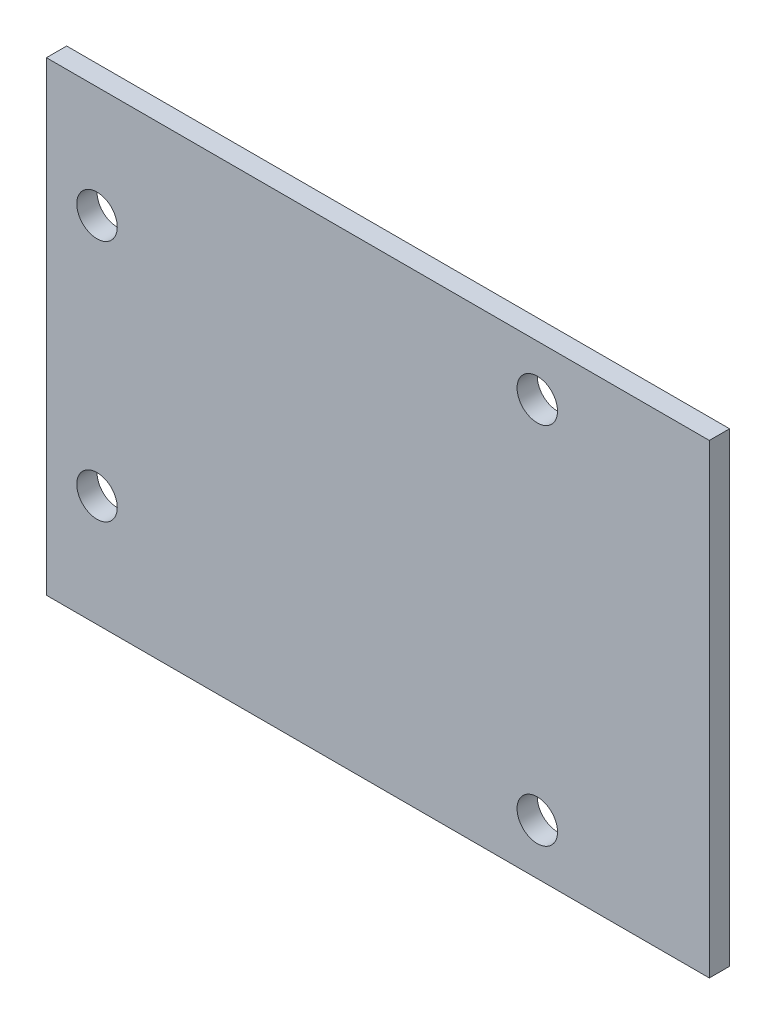
ISO-10303-21;
HEADER;
FILE_DESCRIPTION(('STEP AP214'),'2;1');
FILE_NAME('part.step','',(''),(''),'','','');
FILE_SCHEMA(('AUTOMOTIVE_DESIGN { 1 0 10303 214 1 1 1 1 }'));
ENDSEC;
DATA;
#1=APPLICATION_CONTEXT('core data for automotive mechanical design processes');
#2=APPLICATION_PROTOCOL_DEFINITION('international standard','automotive_design',2000,#1);
#3=PRODUCT_CONTEXT('',#1,'mechanical');
#4=PRODUCT('Part','Part','',(#3));
#5=PRODUCT_RELATED_PRODUCT_CATEGORY('part','',(#4));
#6=PRODUCT_DEFINITION_FORMATION('','',#4);
#7=PRODUCT_DEFINITION_CONTEXT('part definition',#1,'design');
#8=PRODUCT_DEFINITION('design','',#6,#7);
#9=PRODUCT_DEFINITION_SHAPE('','',#8);
#10=(LENGTH_UNIT() NAMED_UNIT(*) SI_UNIT(.MILLI.,.METRE.));
#11=(NAMED_UNIT(*) PLANE_ANGLE_UNIT() SI_UNIT($,.RADIAN.));
#12=(NAMED_UNIT(*) SI_UNIT($,.STERADIAN.) SOLID_ANGLE_UNIT());
#13=UNCERTAINTY_MEASURE_WITH_UNIT(LENGTH_MEASURE(1.E-05),#10,'distance_accuracy_value','');
#14=(GEOMETRIC_REPRESENTATION_CONTEXT(3) GLOBAL_UNCERTAINTY_ASSIGNED_CONTEXT((#13)) GLOBAL_UNIT_ASSIGNED_CONTEXT((#10,
#11,#12)) REPRESENTATION_CONTEXT('',''));
#15=CARTESIAN_POINT('',(0.,0.,0.));
#16=DIRECTION('',(0.,0.,1.));
#17=DIRECTION('',(1.,0.,0.));
#18=AXIS2_PLACEMENT_3D('',#15,#16,#17);
#19=CARTESIAN_POINT('',(0.,0.,2.));
#20=DIRECTION('',(1.,0.,0.));
#21=DIRECTION('',(0.,0.,-1.));
#22=AXIS2_PLACEMENT_3D('',#19,#20,#21);
#23=PLANE('',#22);
#24=DIRECTION('',(0.,-1.,0.));
#25=VECTOR('',#24,1.);
#26=CARTESIAN_POINT('',(0.,0.,0.));
#27=LINE('',#26,#25);
#28=CARTESIAN_POINT('',(0.,46.,0.));
#29=VERTEX_POINT('',#28);
#30=CARTESIAN_POINT('',(0.,0.,0.));
#31=VERTEX_POINT('',#30);
#32=EDGE_CURVE('E96',#29,#31,#27,.T.);
#33=ORIENTED_EDGE('',*,*,#32,.T.);
#34=DIRECTION('',(0.,0.,-1.));
#35=VECTOR('',#34,1.);
#36=CARTESIAN_POINT('',(0.,0.,2.));
#37=LINE('',#36,#35);
#38=CARTESIAN_POINT('',(0.,0.,2.));
#39=VERTEX_POINT('',#38);
#40=EDGE_CURVE('E11',#39,#31,#37,.T.);
#41=ORIENTED_EDGE('',*,*,#40,.F.);
#42=DIRECTION('',(0.,-1.,0.));
#43=VECTOR('',#42,1.);
#44=CARTESIAN_POINT('',(0.,0.,2.));
#45=LINE('',#44,#43);
#46=CARTESIAN_POINT('',(0.,46.,2.));
#47=VERTEX_POINT('',#46);
#48=EDGE_CURVE('E84',#47,#39,#45,.T.);
#49=ORIENTED_EDGE('',*,*,#48,.F.);
#50=DIRECTION('',(0.,0.,-1.));
#51=VECTOR('',#50,1.);
#52=CARTESIAN_POINT('',(0.,46.,2.));
#53=LINE('',#52,#51);
#54=EDGE_CURVE('E92',#47,#29,#53,.T.);
#55=ORIENTED_EDGE('',*,*,#54,.T.);
#56=EDGE_LOOP('',(#33,#41,#49,#55));
#57=FACE_BOUND('',#56,.T.);
#58=ADVANCED_FACE('F33',(#57),#23,.F.);
#59=CARTESIAN_POINT('',(0.,0.,2.));
#60=DIRECTION('',(0.,1.,0.));
#61=DIRECTION('',(0.,0.,1.));
#62=AXIS2_PLACEMENT_3D('',#59,#60,#61);
#63=PLANE('',#62);
#64=DIRECTION('',(1.,0.,0.));
#65=VECTOR('',#64,1.);
#66=CARTESIAN_POINT('',(0.,0.,0.));
#67=LINE('',#66,#65);
#68=CARTESIAN_POINT('',(65.5,0.,0.));
#69=VERTEX_POINT('',#68);
#70=EDGE_CURVE('E88',#31,#69,#67,.T.);
#71=ORIENTED_EDGE('',*,*,#70,.T.);
#72=DIRECTION('',(0.,0.,-1.));
#73=VECTOR('',#72,1.);
#74=CARTESIAN_POINT('',(65.5,0.,2.));
#75=LINE('',#74,#73);
#76=CARTESIAN_POINT('',(65.5,0.,2.));
#77=VERTEX_POINT('',#76);
#78=EDGE_CURVE('E41',#77,#69,#75,.T.);
#79=ORIENTED_EDGE('',*,*,#78,.F.);
#80=DIRECTION('',(1.,0.,0.));
#81=VECTOR('',#80,1.);
#82=CARTESIAN_POINT('',(0.,0.,2.));
#83=LINE('',#82,#81);
#84=EDGE_CURVE('E79',#39,#77,#83,.T.);
#85=ORIENTED_EDGE('',*,*,#84,.F.);
#86=ORIENTED_EDGE('',*,*,#40,.T.);
#87=EDGE_LOOP('',(#71,#79,#85,#86));
#88=FACE_BOUND('',#87,.T.);
#89=ADVANCED_FACE('F87',(#88),#63,.F.);
#90=CARTESIAN_POINT('',(65.5,0.,2.));
#91=DIRECTION('',(-1.,0.,0.));
#92=DIRECTION('',(0.,0.,1.));
#93=AXIS2_PLACEMENT_3D('',#90,#91,#92);
#94=PLANE('',#93);
#95=DIRECTION('',(0.,1.,0.));
#96=VECTOR('',#95,1.);
#97=CARTESIAN_POINT('',(65.5,0.,0.));
#98=LINE('',#97,#96);
#99=CARTESIAN_POINT('',(65.5,46.,0.));
#100=VERTEX_POINT('',#99);
#101=EDGE_CURVE('E66',#69,#100,#98,.T.);
#102=ORIENTED_EDGE('',*,*,#101,.T.);
#103=DIRECTION('',(0.,0.,-1.));
#104=VECTOR('',#103,1.);
#105=CARTESIAN_POINT('',(65.5,46.,2.));
#106=LINE('',#105,#104);
#107=CARTESIAN_POINT('',(65.5,46.,2.));
#108=VERTEX_POINT('',#107);
#109=EDGE_CURVE('E89',#108,#100,#106,.T.);
#110=ORIENTED_EDGE('',*,*,#109,.F.);
#111=DIRECTION('',(0.,1.,0.));
#112=VECTOR('',#111,1.);
#113=CARTESIAN_POINT('',(65.5,0.,2.));
#114=LINE('',#113,#112);
#115=EDGE_CURVE('E82',#77,#108,#114,.T.);
#116=ORIENTED_EDGE('',*,*,#115,.F.);
#117=ORIENTED_EDGE('',*,*,#78,.T.);
#118=EDGE_LOOP('',(#102,#110,#116,#117));
#119=FACE_BOUND('',#118,.T.);
#120=ADVANCED_FACE('F90',(#119),#94,.F.);
#121=CARTESIAN_POINT('',(0.,46.,2.));
#122=DIRECTION('',(0.,-1.,0.));
#123=DIRECTION('',(0.,0.,-1.));
#124=AXIS2_PLACEMENT_3D('',#121,#122,#123);
#125=PLANE('',#124);
#126=DIRECTION('',(-1.,0.,0.));
#127=VECTOR('',#126,1.);
#128=CARTESIAN_POINT('',(0.,46.,0.));
#129=LINE('',#128,#127);
#130=EDGE_CURVE('E72',#100,#29,#129,.T.);
#131=ORIENTED_EDGE('',*,*,#130,.T.);
#132=ORIENTED_EDGE('',*,*,#54,.F.);
#133=DIRECTION('',(-1.,0.,0.));
#134=VECTOR('',#133,1.);
#135=CARTESIAN_POINT('',(0.,46.,2.));
#136=LINE('',#135,#134);
#137=EDGE_CURVE('E49',#108,#47,#136,.T.);
#138=ORIENTED_EDGE('',*,*,#137,.F.);
#139=ORIENTED_EDGE('',*,*,#109,.T.);
#140=EDGE_LOOP('',(#131,#132,#138,#139));
#141=FACE_BOUND('',#140,.T.);
#142=ADVANCED_FACE('F104',(#141),#125,.F.);
#143=CARTESIAN_POINT('',(0.,0.,2.));
#144=DIRECTION('',(0.,0.,-1.));
#145=DIRECTION('',(-1.,0.,0.));
#146=AXIS2_PLACEMENT_3D('',#143,#144,#145);
#147=PLANE('',#146);
#148=CARTESIAN_POINT('',(5.,35.,2.));
#149=DIRECTION('',(0.,0.,1.));
#150=DIRECTION('',(1.,0.,0.));
#151=AXIS2_PLACEMENT_3D('',#148,#149,#150);
#152=CIRCLE('',#151,2.);
#153=CARTESIAN_POINT('',(7.00000000000001,35.,2.));
#154=VERTEX_POINT('',#153);
#155=EDGE_CURVE('E128',#154,#154,#152,.T.);
#156=ORIENTED_EDGE('',*,*,#155,.F.);
#157=EDGE_LOOP('',(#156));
#158=FACE_BOUND('',#157,.T.);
#159=CARTESIAN_POINT('',(48.5,41.,2.));
#160=DIRECTION('',(0.,0.,1.));
#161=DIRECTION('',(1.,0.,0.));
#162=AXIS2_PLACEMENT_3D('',#159,#160,#161);
#163=CIRCLE('',#162,2.);
#164=CARTESIAN_POINT('',(50.5,41.,2.));
#165=VERTEX_POINT('',#164);
#166=EDGE_CURVE('E122',#165,#165,#163,.T.);
#167=ORIENTED_EDGE('',*,*,#166,.F.);
#168=EDGE_LOOP('',(#167));
#169=FACE_BOUND('',#168,.T.);
#170=CARTESIAN_POINT('',(48.5,5.,2.));
#171=DIRECTION('',(0.,0.,1.));
#172=DIRECTION('',(1.,0.,0.));
#173=AXIS2_PLACEMENT_3D('',#170,#171,#172);
#174=CIRCLE('',#173,2.);
#175=CARTESIAN_POINT('',(50.5,5.,2.));
#176=VERTEX_POINT('',#175);
#177=EDGE_CURVE('E116',#176,#176,#174,.T.);
#178=ORIENTED_EDGE('',*,*,#177,.F.);
#179=EDGE_LOOP('',(#178));
#180=FACE_BOUND('',#179,.T.);
#181=CARTESIAN_POINT('',(5.,11.,2.));
#182=DIRECTION('',(0.,0.,1.));
#183=DIRECTION('',(1.,0.,0.));
#184=AXIS2_PLACEMENT_3D('',#181,#182,#183);
#185=CIRCLE('',#184,2.);
#186=CARTESIAN_POINT('',(7.,11.,2.));
#187=VERTEX_POINT('',#186);
#188=EDGE_CURVE('E110',#187,#187,#185,.T.);
#189=ORIENTED_EDGE('',*,*,#188,.F.);
#190=EDGE_LOOP('',(#189));
#191=FACE_BOUND('',#190,.T.);
#192=ORIENTED_EDGE('',*,*,#48,.T.);
#193=ORIENTED_EDGE('',*,*,#84,.T.);
#194=ORIENTED_EDGE('',*,*,#115,.T.);
#195=ORIENTED_EDGE('',*,*,#137,.T.);
#196=EDGE_LOOP('',(#192,#193,#194,#195));
#197=FACE_BOUND('',#196,.T.);
#198=ADVANCED_FACE('F80',(#158,#169,#180,#191,#197),#147,.F.);
#199=CARTESIAN_POINT('',(0.,0.,0.));
#200=DIRECTION('',(0.,0.,-1.));
#201=DIRECTION('',(-1.,0.,0.));
#202=AXIS2_PLACEMENT_3D('',#199,#200,#201);
#203=PLANE('',#202);
#204=CARTESIAN_POINT('',(5.,35.,0.));
#205=DIRECTION('',(0.,0.,1.));
#206=DIRECTION('',(1.,0.,0.));
#207=AXIS2_PLACEMENT_3D('',#204,#205,#206);
#208=CIRCLE('',#207,2.);
#209=CARTESIAN_POINT('',(7.00000000000001,35.,0.));
#210=VERTEX_POINT('',#209);
#211=EDGE_CURVE('E113',#210,#210,#208,.T.);
#212=ORIENTED_EDGE('',*,*,#211,.T.);
#213=EDGE_LOOP('',(#212));
#214=FACE_BOUND('',#213,.T.);
#215=CARTESIAN_POINT('',(48.5,41.,0.));
#216=DIRECTION('',(0.,0.,1.));
#217=DIRECTION('',(1.,0.,0.));
#218=AXIS2_PLACEMENT_3D('',#215,#216,#217);
#219=CIRCLE('',#218,2.);
#220=CARTESIAN_POINT('',(50.5,41.,0.));
#221=VERTEX_POINT('',#220);
#222=EDGE_CURVE('E125',#221,#221,#219,.T.);
#223=ORIENTED_EDGE('',*,*,#222,.T.);
#224=EDGE_LOOP('',(#223));
#225=FACE_BOUND('',#224,.T.);
#226=CARTESIAN_POINT('',(48.5,5.,0.));
#227=DIRECTION('',(0.,0.,1.));
#228=DIRECTION('',(1.,0.,0.));
#229=AXIS2_PLACEMENT_3D('',#226,#227,#228);
#230=CIRCLE('',#229,2.);
#231=CARTESIAN_POINT('',(50.5,5.,0.));
#232=VERTEX_POINT('',#231);
#233=EDGE_CURVE('E119',#232,#232,#230,.T.);
#234=ORIENTED_EDGE('',*,*,#233,.T.);
#235=EDGE_LOOP('',(#234));
#236=FACE_BOUND('',#235,.T.);
#237=CARTESIAN_POINT('',(5.,11.,0.));
#238=DIRECTION('',(0.,0.,1.));
#239=DIRECTION('',(1.,0.,0.));
#240=AXIS2_PLACEMENT_3D('',#237,#238,#239);
#241=CIRCLE('',#240,2.);
#242=CARTESIAN_POINT('',(7.,11.,0.));
#243=VERTEX_POINT('',#242);
#244=EDGE_CURVE('E99',#243,#243,#241,.T.);
#245=ORIENTED_EDGE('',*,*,#244,.T.);
#246=EDGE_LOOP('',(#245));
#247=FACE_BOUND('',#246,.T.);
#248=ORIENTED_EDGE('',*,*,#32,.F.);
#249=ORIENTED_EDGE('',*,*,#130,.F.);
#250=ORIENTED_EDGE('',*,*,#101,.F.);
#251=ORIENTED_EDGE('',*,*,#70,.F.);
#252=EDGE_LOOP('',(#248,#249,#250,#251));
#253=FACE_BOUND('',#252,.T.);
#254=ADVANCED_FACE('F107',(#214,#225,#236,#247,#253),#203,.T.);
#255=CARTESIAN_POINT('',(5.,11.,0.));
#256=DIRECTION('',(0.,0.,1.));
#257=DIRECTION('',(1.,0.,0.));
#258=AXIS2_PLACEMENT_3D('',#255,#256,#257);
#259=CYLINDRICAL_SURFACE('',#258,2.);
#260=ORIENTED_EDGE('',*,*,#244,.F.);
#261=EDGE_LOOP('',(#260));
#262=FACE_BOUND('',#261,.T.);
#263=ORIENTED_EDGE('',*,*,#188,.T.);
#264=EDGE_LOOP('',(#263));
#265=FACE_BOUND('',#264,.T.);
#266=ADVANCED_FACE('F152',(#262,#265),#259,.F.);
#267=CARTESIAN_POINT('',(48.5,5.,0.));
#268=DIRECTION('',(0.,0.,1.));
#269=DIRECTION('',(1.,0.,0.));
#270=AXIS2_PLACEMENT_3D('',#267,#268,#269);
#271=CYLINDRICAL_SURFACE('',#270,2.);
#272=ORIENTED_EDGE('',*,*,#233,.F.);
#273=EDGE_LOOP('',(#272));
#274=FACE_BOUND('',#273,.T.);
#275=ORIENTED_EDGE('',*,*,#177,.T.);
#276=EDGE_LOOP('',(#275));
#277=FACE_BOUND('',#276,.T.);
#278=ADVANCED_FACE('F154',(#274,#277),#271,.F.);
#279=CARTESIAN_POINT('',(48.5,41.,0.));
#280=DIRECTION('',(0.,0.,1.));
#281=DIRECTION('',(1.,0.,0.));
#282=AXIS2_PLACEMENT_3D('',#279,#280,#281);
#283=CYLINDRICAL_SURFACE('',#282,2.);
#284=ORIENTED_EDGE('',*,*,#222,.F.);
#285=EDGE_LOOP('',(#284));
#286=FACE_BOUND('',#285,.T.);
#287=ORIENTED_EDGE('',*,*,#166,.T.);
#288=EDGE_LOOP('',(#287));
#289=FACE_BOUND('',#288,.T.);
#290=ADVANCED_FACE('F139',(#286,#289),#283,.F.);
#291=CARTESIAN_POINT('',(5.,35.,0.));
#292=DIRECTION('',(0.,0.,1.));
#293=DIRECTION('',(1.,0.,0.));
#294=AXIS2_PLACEMENT_3D('',#291,#292,#293);
#295=CYLINDRICAL_SURFACE('',#294,2.);
#296=ORIENTED_EDGE('',*,*,#211,.F.);
#297=EDGE_LOOP('',(#296));
#298=FACE_BOUND('',#297,.T.);
#299=ORIENTED_EDGE('',*,*,#155,.T.);
#300=EDGE_LOOP('',(#299));
#301=FACE_BOUND('',#300,.T.);
#302=ADVANCED_FACE('F136',(#298,#301),#295,.F.);
#303=CLOSED_SHELL('',(#58,#89,#120,#142,#198,#254,#266,#278,#290,#302));
#304=MANIFOLD_SOLID_BREP('B2',#303);
#305=ADVANCED_BREP_SHAPE_REPRESENTATION('',(#18,#304),#14);
#306=SHAPE_DEFINITION_REPRESENTATION(#9,#305);
ENDSEC;
END-ISO-10303-21;
